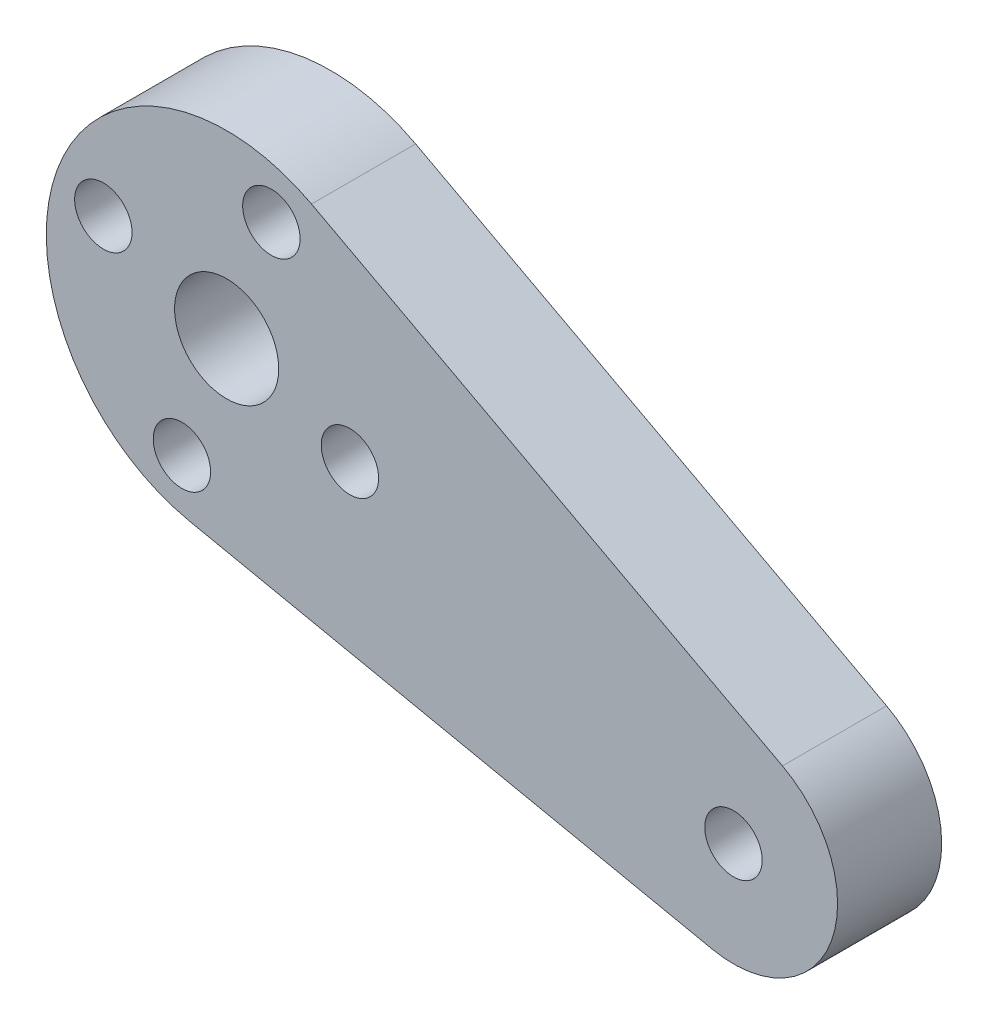
ISO-10303-21;
HEADER;
FILE_DESCRIPTION(('STEP AP214'),'2;1');
FILE_NAME('part.step','',(''),(''),'','','');
FILE_SCHEMA(('AUTOMOTIVE_DESIGN { 1 0 10303 214 1 1 1 1 }'));
ENDSEC;
DATA;
#1=APPLICATION_CONTEXT('core data for automotive mechanical design processes');
#2=APPLICATION_PROTOCOL_DEFINITION('international standard','automotive_design',2000,#1);
#3=PRODUCT_CONTEXT('',#1,'mechanical');
#4=PRODUCT('Part','Part','',(#3));
#5=PRODUCT_RELATED_PRODUCT_CATEGORY('part','',(#4));
#6=PRODUCT_DEFINITION_FORMATION('','',#4);
#7=PRODUCT_DEFINITION_CONTEXT('part definition',#1,'design');
#8=PRODUCT_DEFINITION('design','',#6,#7);
#9=PRODUCT_DEFINITION_SHAPE('','',#8);
#10=(LENGTH_UNIT() NAMED_UNIT(*) SI_UNIT(.MILLI.,.METRE.));
#11=(NAMED_UNIT(*) PLANE_ANGLE_UNIT() SI_UNIT($,.RADIAN.));
#12=(NAMED_UNIT(*) SI_UNIT($,.STERADIAN.) SOLID_ANGLE_UNIT());
#13=UNCERTAINTY_MEASURE_WITH_UNIT(LENGTH_MEASURE(1.E-05),#10,'distance_accuracy_value','');
#14=(GEOMETRIC_REPRESENTATION_CONTEXT(3) GLOBAL_UNCERTAINTY_ASSIGNED_CONTEXT((#13)) GLOBAL_UNIT_ASSIGNED_CONTEXT((#10,
#11,#12)) REPRESENTATION_CONTEXT('',''));
#15=CARTESIAN_POINT('',(0.,0.,0.));
#16=DIRECTION('',(0.,0.,1.));
#17=DIRECTION('',(1.,0.,0.));
#18=AXIS2_PLACEMENT_3D('',#15,#16,#17);
#19=CARTESIAN_POINT('',(46.2285417845309,266.7,6.35));
#20=DIRECTION('',(0.,0.,1.));
#21=DIRECTION('',(1.,0.,0.));
#22=AXIS2_PLACEMENT_3D('',#19,#20,#21);
#23=PLANE('',#22);
#24=CARTESIAN_POINT('',(38.7081396394676,269.428287297285,6.35));
#25=DIRECTION('',(0.,0.,1.));
#26=DIRECTION('',(1.,0.,0.));
#27=AXIS2_PLACEMENT_3D('',#24,#25,#26);
#28=CIRCLE('',#27,1.75);
#29=CARTESIAN_POINT('',(40.4581396394676,269.428287297285,6.35));
#30=VERTEX_POINT('',#29);
#31=EDGE_CURVE('E133',#30,#30,#28,.T.);
#32=ORIENTED_EDGE('',*,*,#31,.F.);
#33=EDGE_LOOP('',(#32));
#34=FACE_BOUND('',#33,.T.);
#35=CARTESIAN_POINT('',(77.1396310992052,255.485927840596,6.35));
#36=DIRECTION('',(0.,0.,1.));
#37=DIRECTION('',(1.,0.,0.));
#38=AXIS2_PLACEMENT_3D('',#35,#36,#37);
#39=CIRCLE('',#38,1.75);
#40=CARTESIAN_POINT('',(78.8896310992052,255.485927840596,6.35));
#41=VERTEX_POINT('',#40);
#42=EDGE_CURVE('E121',#41,#41,#39,.T.);
#43=ORIENTED_EDGE('',*,*,#42,.F.);
#44=EDGE_LOOP('',(#43));
#45=FACE_BOUND('',#44,.T.);
#46=CARTESIAN_POINT('',(46.2285417845309,266.7,6.35));
#47=DIRECTION('',(0.,0.,1.));
#48=DIRECTION('',(1.,0.,0.));
#49=AXIS2_PLACEMENT_3D('',#46,#47,#48);
#50=CIRCLE('',#49,3.175);
#51=CARTESIAN_POINT('',(49.4035417845309,266.7,6.35));
#52=VERTEX_POINT('',#51);
#53=EDGE_CURVE('E100',#52,#52,#50,.T.);
#54=ORIENTED_EDGE('',*,*,#53,.F.);
#55=EDGE_LOOP('',(#54));
#56=FACE_BOUND('',#55,.T.);
#57=CARTESIAN_POINT('',(46.2285417845309,266.7,6.35));
#58=DIRECTION('',(0.,0.,1.));
#59=DIRECTION('',(1.,0.,0.));
#60=AXIS2_PLACEMENT_3D('',#57,#58,#59);
#61=CIRCLE('',#60,11.);
#62=CARTESIAN_POINT('',(51.4045277197129,276.406140819028,6.35));
#63=VERTEX_POINT('',#62);
#64=CARTESIAN_POINT('',(43.9771356694452,255.932866188955,6.35));
#65=VERTEX_POINT('',#64);
#66=EDGE_CURVE('E85',#63,#65,#61,.T.);
#67=ORIENTED_EDGE('',*,*,#66,.T.);
#68=DIRECTION('',(0.978830346458663,-0.204673283189608,0.));
#69=VECTOR('',#68,1.);
#70=CARTESIAN_POINT('',(43.9771356694452,255.932866188955,6.35));
#71=LINE('',#70,#69);
#72=CARTESIAN_POINT('',(75.8399557509512,249.270355140584,6.35));
#73=VERTEX_POINT('',#72);
#74=EDGE_CURVE('E80',#65,#73,#71,.T.);
#75=ORIENTED_EDGE('',*,*,#74,.T.);
#76=CARTESIAN_POINT('',(77.1396310992052,255.485927840596,6.35));
#77=DIRECTION('',(0.,0.,1.));
#78=DIRECTION('',(1.,0.,0.));
#79=AXIS2_PLACEMENT_3D('',#76,#77,#78);
#80=CIRCLE('',#79,6.35);
#81=CARTESIAN_POINT('',(80.127586616333,261.089018222489,6.35));
#82=VERTEX_POINT('',#81);
#83=EDGE_CURVE('E83',#73,#82,#80,.T.);
#84=ORIENTED_EDGE('',*,*,#83,.T.);
#85=DIRECTION('',(-0.882376438093434,0.470544175925645,0.));
#86=VECTOR('',#85,1.);
#87=CARTESIAN_POINT('',(51.4045277197129,276.406140819028,6.35));
#88=LINE('',#87,#86);
#89=EDGE_CURVE('E50',#82,#63,#88,.T.);
#90=ORIENTED_EDGE('',*,*,#89,.T.);
#91=EDGE_LOOP('',(#67,#75,#84,#90));
#92=FACE_BOUND('',#91,.T.);
#93=CARTESIAN_POINT('',(53.7489439295941,263.971712702715,6.35));
#94=DIRECTION('',(0.,0.,1.));
#95=DIRECTION('',(1.,0.,0.));
#96=AXIS2_PLACEMENT_3D('',#93,#94,#95);
#97=CIRCLE('',#96,1.75);
#98=CARTESIAN_POINT('',(55.4989439295941,263.971712702715,6.35));
#99=VERTEX_POINT('',#98);
#100=EDGE_CURVE('E115',#99,#99,#97,.T.);
#101=ORIENTED_EDGE('',*,*,#100,.F.);
#102=EDGE_LOOP('',(#101));
#103=FACE_BOUND('',#102,.T.);
#104=CARTESIAN_POINT('',(43.5002544872457,259.179597854937,6.35));
#105=DIRECTION('',(0.,0.,1.));
#106=DIRECTION('',(1.,0.,0.));
#107=AXIS2_PLACEMENT_3D('',#104,#105,#106);
#108=CIRCLE('',#107,1.74999999999998);
#109=CARTESIAN_POINT('',(45.2502544872457,259.179597854937,6.35));
#110=VERTEX_POINT('',#109);
#111=EDGE_CURVE('E127',#110,#110,#108,.T.);
#112=ORIENTED_EDGE('',*,*,#111,.F.);
#113=EDGE_LOOP('',(#112));
#114=FACE_BOUND('',#113,.T.);
#115=CARTESIAN_POINT('',(48.9568290818161,274.220402145063,6.35));
#116=DIRECTION('',(0.,0.,1.));
#117=DIRECTION('',(1.,0.,0.));
#118=AXIS2_PLACEMENT_3D('',#115,#116,#117);
#119=CIRCLE('',#118,1.74999999999998);
#120=CARTESIAN_POINT('',(50.7068290818161,274.220402145063,6.35));
#121=VERTEX_POINT('',#120);
#122=EDGE_CURVE('E139',#121,#121,#119,.T.);
#123=ORIENTED_EDGE('',*,*,#122,.F.);
#124=EDGE_LOOP('',(#123));
#125=FACE_BOUND('',#124,.T.);
#126=ADVANCED_FACE('F33',(#34,#45,#56,#92,#103,#114,#125),#23,.T.);
#127=CARTESIAN_POINT('',(46.2285417845309,266.7,0.));
#128=DIRECTION('',(0.,0.,1.));
#129=DIRECTION('',(1.,0.,0.));
#130=AXIS2_PLACEMENT_3D('',#127,#128,#129);
#131=PLANE('',#130);
#132=CARTESIAN_POINT('',(38.7081396394676,269.428287297285,0.));
#133=DIRECTION('',(0.,0.,1.));
#134=DIRECTION('',(1.,0.,0.));
#135=AXIS2_PLACEMENT_3D('',#132,#133,#134);
#136=CIRCLE('',#135,1.75);
#137=CARTESIAN_POINT('',(40.4581396394676,269.428287297285,0.));
#138=VERTEX_POINT('',#137);
#139=EDGE_CURVE('E136',#138,#138,#136,.T.);
#140=ORIENTED_EDGE('',*,*,#139,.T.);
#141=EDGE_LOOP('',(#140));
#142=FACE_BOUND('',#141,.T.);
#143=CARTESIAN_POINT('',(77.1396310992052,255.485927840596,0.));
#144=DIRECTION('',(0.,0.,1.));
#145=DIRECTION('',(1.,0.,0.));
#146=AXIS2_PLACEMENT_3D('',#143,#144,#145);
#147=CIRCLE('',#146,1.75);
#148=CARTESIAN_POINT('',(78.8896310992052,255.485927840596,0.));
#149=VERTEX_POINT('',#148);
#150=EDGE_CURVE('E124',#149,#149,#147,.T.);
#151=ORIENTED_EDGE('',*,*,#150,.T.);
#152=EDGE_LOOP('',(#151));
#153=FACE_BOUND('',#152,.T.);
#154=CARTESIAN_POINT('',(46.2285417845309,266.7,0.));
#155=DIRECTION('',(0.,0.,1.));
#156=DIRECTION('',(1.,0.,0.));
#157=AXIS2_PLACEMENT_3D('',#154,#155,#156);
#158=CIRCLE('',#157,3.175);
#159=CARTESIAN_POINT('',(49.4035417845309,266.7,0.));
#160=VERTEX_POINT('',#159);
#161=EDGE_CURVE('E112',#160,#160,#158,.T.);
#162=ORIENTED_EDGE('',*,*,#161,.T.);
#163=EDGE_LOOP('',(#162));
#164=FACE_BOUND('',#163,.T.);
#165=CARTESIAN_POINT('',(46.2285417845309,266.7,0.));
#166=DIRECTION('',(0.,0.,1.));
#167=DIRECTION('',(1.,0.,0.));
#168=AXIS2_PLACEMENT_3D('',#165,#166,#167);
#169=CIRCLE('',#168,11.);
#170=CARTESIAN_POINT('',(51.4045277197129,276.406140819028,0.));
#171=VERTEX_POINT('',#170);
#172=CARTESIAN_POINT('',(43.9771356694452,255.932866188955,0.));
#173=VERTEX_POINT('',#172);
#174=EDGE_CURVE('E97',#171,#173,#169,.T.);
#175=ORIENTED_EDGE('',*,*,#174,.F.);
#176=DIRECTION('',(-0.882376438093434,0.470544175925645,0.));
#177=VECTOR('',#176,1.);
#178=CARTESIAN_POINT('',(51.4045277197129,276.406140819028,0.));
#179=LINE('',#178,#177);
#180=CARTESIAN_POINT('',(80.127586616333,261.089018222489,0.));
#181=VERTEX_POINT('',#180);
#182=EDGE_CURVE('E73',#181,#171,#179,.T.);
#183=ORIENTED_EDGE('',*,*,#182,.F.);
#184=CARTESIAN_POINT('',(77.1396310992052,255.485927840596,0.));
#185=DIRECTION('',(0.,0.,1.));
#186=DIRECTION('',(1.,0.,0.));
#187=AXIS2_PLACEMENT_3D('',#184,#185,#186);
#188=CIRCLE('',#187,6.35);
#189=CARTESIAN_POINT('',(75.8399557509512,249.270355140584,0.));
#190=VERTEX_POINT('',#189);
#191=EDGE_CURVE('E67',#190,#181,#188,.T.);
#192=ORIENTED_EDGE('',*,*,#191,.F.);
#193=DIRECTION('',(0.978830346458663,-0.204673283189608,0.));
#194=VECTOR('',#193,1.);
#195=CARTESIAN_POINT('',(43.9771356694452,255.932866188955,0.));
#196=LINE('',#195,#194);
#197=EDGE_CURVE('E89',#173,#190,#196,.T.);
#198=ORIENTED_EDGE('',*,*,#197,.F.);
#199=EDGE_LOOP('',(#175,#183,#192,#198));
#200=FACE_BOUND('',#199,.T.);
#201=CARTESIAN_POINT('',(53.7489439295941,263.971712702715,0.));
#202=DIRECTION('',(0.,0.,1.));
#203=DIRECTION('',(1.,0.,0.));
#204=AXIS2_PLACEMENT_3D('',#201,#202,#203);
#205=CIRCLE('',#204,1.75);
#206=CARTESIAN_POINT('',(55.4989439295941,263.971712702715,0.));
#207=VERTEX_POINT('',#206);
#208=EDGE_CURVE('E118',#207,#207,#205,.T.);
#209=ORIENTED_EDGE('',*,*,#208,.T.);
#210=EDGE_LOOP('',(#209));
#211=FACE_BOUND('',#210,.T.);
#212=CARTESIAN_POINT('',(43.5002544872457,259.179597854937,0.));
#213=DIRECTION('',(0.,0.,1.));
#214=DIRECTION('',(1.,0.,0.));
#215=AXIS2_PLACEMENT_3D('',#212,#213,#214);
#216=CIRCLE('',#215,1.74999999999998);
#217=CARTESIAN_POINT('',(45.2502544872457,259.179597854937,0.));
#218=VERTEX_POINT('',#217);
#219=EDGE_CURVE('E130',#218,#218,#216,.T.);
#220=ORIENTED_EDGE('',*,*,#219,.T.);
#221=EDGE_LOOP('',(#220));
#222=FACE_BOUND('',#221,.T.);
#223=CARTESIAN_POINT('',(48.9568290818161,274.220402145063,0.));
#224=DIRECTION('',(0.,0.,1.));
#225=DIRECTION('',(1.,0.,0.));
#226=AXIS2_PLACEMENT_3D('',#223,#224,#225);
#227=CIRCLE('',#226,1.74999999999998);
#228=CARTESIAN_POINT('',(50.7068290818161,274.220402145063,0.));
#229=VERTEX_POINT('',#228);
#230=EDGE_CURVE('E142',#229,#229,#227,.T.);
#231=ORIENTED_EDGE('',*,*,#230,.T.);
#232=EDGE_LOOP('',(#231));
#233=FACE_BOUND('',#232,.T.);
#234=ADVANCED_FACE('F108',(#142,#153,#164,#200,#211,#222,#233),#131,.F.);
#235=CARTESIAN_POINT('',(46.2285417845309,266.7,6.35));
#236=DIRECTION('',(0.,0.,-1.));
#237=DIRECTION('',(-1.,0.,0.));
#238=AXIS2_PLACEMENT_3D('',#235,#236,#237);
#239=CYLINDRICAL_SURFACE('',#238,11.);
#240=ORIENTED_EDGE('',*,*,#174,.T.);
#241=DIRECTION('',(0.,0.,-1.));
#242=VECTOR('',#241,1.);
#243=CARTESIAN_POINT('',(43.9771356694452,255.932866188955,6.35));
#244=LINE('',#243,#242);
#245=EDGE_CURVE('E11',#65,#173,#244,.T.);
#246=ORIENTED_EDGE('',*,*,#245,.F.);
#247=ORIENTED_EDGE('',*,*,#66,.F.);
#248=DIRECTION('',(0.,0.,-1.));
#249=VECTOR('',#248,1.);
#250=CARTESIAN_POINT('',(51.4045277197129,276.406140819028,6.35));
#251=LINE('',#250,#249);
#252=EDGE_CURVE('E93',#63,#171,#251,.T.);
#253=ORIENTED_EDGE('',*,*,#252,.T.);
#254=EDGE_LOOP('',(#240,#246,#247,#253));
#255=FACE_BOUND('',#254,.T.);
#256=ADVANCED_FACE('F35',(#255),#239,.T.);
#257=CARTESIAN_POINT('',(43.9771356694452,255.932866188955,6.35));
#258=DIRECTION('',(0.204673283189608,0.978830346458663,0.));
#259=DIRECTION('',(-0.978830346458663,0.204673283189608,0.));
#260=AXIS2_PLACEMENT_3D('',#257,#258,#259);
#261=PLANE('',#260);
#262=ORIENTED_EDGE('',*,*,#197,.T.);
#263=DIRECTION('',(0.,0.,-1.));
#264=VECTOR('',#263,1.);
#265=CARTESIAN_POINT('',(75.8399557509512,249.270355140584,6.35));
#266=LINE('',#265,#264);
#267=EDGE_CURVE('E42',#73,#190,#266,.T.);
#268=ORIENTED_EDGE('',*,*,#267,.F.);
#269=ORIENTED_EDGE('',*,*,#74,.F.);
#270=ORIENTED_EDGE('',*,*,#245,.T.);
#271=EDGE_LOOP('',(#262,#268,#269,#270));
#272=FACE_BOUND('',#271,.T.);
#273=ADVANCED_FACE('F88',(#272),#261,.F.);
#274=CARTESIAN_POINT('',(77.1396310992052,255.485927840596,6.35));
#275=DIRECTION('',(0.,0.,-1.));
#276=DIRECTION('',(-1.,0.,0.));
#277=AXIS2_PLACEMENT_3D('',#274,#275,#276);
#278=CYLINDRICAL_SURFACE('',#277,6.35);
#279=ORIENTED_EDGE('',*,*,#191,.T.);
#280=DIRECTION('',(0.,0.,-1.));
#281=VECTOR('',#280,1.);
#282=CARTESIAN_POINT('',(80.127586616333,261.089018222489,6.35));
#283=LINE('',#282,#281);
#284=EDGE_CURVE('E90',#82,#181,#283,.T.);
#285=ORIENTED_EDGE('',*,*,#284,.F.);
#286=ORIENTED_EDGE('',*,*,#83,.F.);
#287=ORIENTED_EDGE('',*,*,#267,.T.);
#288=EDGE_LOOP('',(#279,#285,#286,#287));
#289=FACE_BOUND('',#288,.T.);
#290=ADVANCED_FACE('F91',(#289),#278,.T.);
#291=CARTESIAN_POINT('',(51.4045277197129,276.406140819028,6.35));
#292=DIRECTION('',(-0.470544175925644,-0.882376438093434,0.));
#293=DIRECTION('',(0.882376438093434,-0.470544175925645,0.));
#294=AXIS2_PLACEMENT_3D('',#291,#292,#293);
#295=PLANE('',#294);
#296=ORIENTED_EDGE('',*,*,#182,.T.);
#297=ORIENTED_EDGE('',*,*,#252,.F.);
#298=ORIENTED_EDGE('',*,*,#89,.F.);
#299=ORIENTED_EDGE('',*,*,#284,.T.);
#300=EDGE_LOOP('',(#296,#297,#298,#299));
#301=FACE_BOUND('',#300,.T.);
#302=ADVANCED_FACE('F105',(#301),#295,.F.);
#303=CARTESIAN_POINT('',(46.2285417845309,266.7,6.35));
#304=DIRECTION('',(0.,0.,-1.));
#305=DIRECTION('',(-1.,0.,0.));
#306=AXIS2_PLACEMENT_3D('',#303,#304,#305);
#307=CYLINDRICAL_SURFACE('',#306,3.175);
#308=ORIENTED_EDGE('',*,*,#53,.T.);
#309=EDGE_LOOP('',(#308));
#310=FACE_BOUND('',#309,.T.);
#311=ORIENTED_EDGE('',*,*,#161,.F.);
#312=EDGE_LOOP('',(#311));
#313=FACE_BOUND('',#312,.T.);
#314=ADVANCED_FACE('F162',(#310,#313),#307,.F.);
#315=CARTESIAN_POINT('',(53.7489439295941,263.971712702715,6.35));
#316=DIRECTION('',(0.,0.,-1.));
#317=DIRECTION('',(-1.,0.,0.));
#318=AXIS2_PLACEMENT_3D('',#315,#316,#317);
#319=CYLINDRICAL_SURFACE('',#318,1.75);
#320=ORIENTED_EDGE('',*,*,#100,.T.);
#321=EDGE_LOOP('',(#320));
#322=FACE_BOUND('',#321,.T.);
#323=ORIENTED_EDGE('',*,*,#208,.F.);
#324=EDGE_LOOP('',(#323));
#325=FACE_BOUND('',#324,.T.);
#326=ADVANCED_FACE('F208',(#322,#325),#319,.F.);
#327=CARTESIAN_POINT('',(77.1396310992052,255.485927840596,6.35));
#328=DIRECTION('',(0.,0.,-1.));
#329=DIRECTION('',(-1.,0.,0.));
#330=AXIS2_PLACEMENT_3D('',#327,#328,#329);
#331=CYLINDRICAL_SURFACE('',#330,1.75);
#332=ORIENTED_EDGE('',*,*,#42,.T.);
#333=EDGE_LOOP('',(#332));
#334=FACE_BOUND('',#333,.T.);
#335=ORIENTED_EDGE('',*,*,#150,.F.);
#336=EDGE_LOOP('',(#335));
#337=FACE_BOUND('',#336,.T.);
#338=ADVANCED_FACE('F216',(#334,#337),#331,.F.);
#339=CARTESIAN_POINT('',(43.5002544872457,259.179597854937,6.35));
#340=DIRECTION('',(0.,0.,-1.));
#341=DIRECTION('',(-1.,0.,0.));
#342=AXIS2_PLACEMENT_3D('',#339,#340,#341);
#343=CYLINDRICAL_SURFACE('',#342,1.74999999999998);
#344=ORIENTED_EDGE('',*,*,#111,.T.);
#345=EDGE_LOOP('',(#344));
#346=FACE_BOUND('',#345,.T.);
#347=ORIENTED_EDGE('',*,*,#219,.F.);
#348=EDGE_LOOP('',(#347));
#349=FACE_BOUND('',#348,.T.);
#350=ADVANCED_FACE('F224',(#346,#349),#343,.F.);
#351=CARTESIAN_POINT('',(38.7081396394676,269.428287297285,6.35));
#352=DIRECTION('',(0.,0.,-1.));
#353=DIRECTION('',(-1.,0.,0.));
#354=AXIS2_PLACEMENT_3D('',#351,#352,#353);
#355=CYLINDRICAL_SURFACE('',#354,1.75);
#356=ORIENTED_EDGE('',*,*,#31,.T.);
#357=EDGE_LOOP('',(#356));
#358=FACE_BOUND('',#357,.T.);
#359=ORIENTED_EDGE('',*,*,#139,.F.);
#360=EDGE_LOOP('',(#359));
#361=FACE_BOUND('',#360,.T.);
#362=ADVANCED_FACE('F233',(#358,#361),#355,.F.);
#363=CARTESIAN_POINT('',(48.9568290818161,274.220402145063,6.35));
#364=DIRECTION('',(0.,0.,-1.));
#365=DIRECTION('',(-1.,0.,0.));
#366=AXIS2_PLACEMENT_3D('',#363,#364,#365);
#367=CYLINDRICAL_SURFACE('',#366,1.74999999999998);
#368=ORIENTED_EDGE('',*,*,#122,.T.);
#369=EDGE_LOOP('',(#368));
#370=FACE_BOUND('',#369,.T.);
#371=ORIENTED_EDGE('',*,*,#230,.F.);
#372=EDGE_LOOP('',(#371));
#373=FACE_BOUND('',#372,.T.);
#374=ADVANCED_FACE('F148',(#370,#373),#367,.F.);
#375=CLOSED_SHELL('',(#126,#234,#256,#273,#290,#302,#314,#326,#338,#350,#362,#374));
#376=MANIFOLD_SOLID_BREP('B2',#375);
#377=ADVANCED_BREP_SHAPE_REPRESENTATION('',(#18,#376),#14);
#378=SHAPE_DEFINITION_REPRESENTATION(#9,#377);
ENDSEC;
END-ISO-10303-21;
